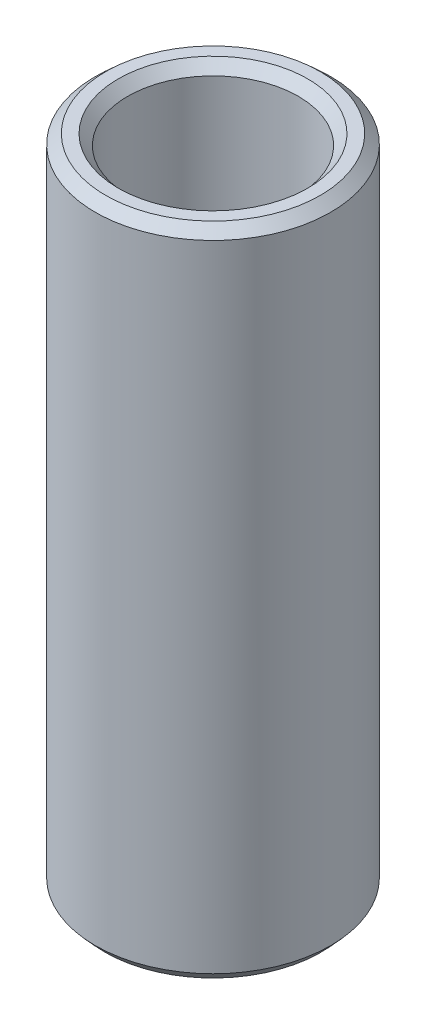
ISO-10303-21;
HEADER;
FILE_DESCRIPTION(('STEP AP214'),'2;1');
FILE_NAME('part.step','',(''),(''),'','','');
FILE_SCHEMA(('AUTOMOTIVE_DESIGN { 1 0 10303 214 1 1 1 1 }'));
ENDSEC;
DATA;
#1=APPLICATION_CONTEXT('core data for automotive mechanical design processes');
#2=APPLICATION_PROTOCOL_DEFINITION('international standard','automotive_design',2000,#1);
#3=PRODUCT_CONTEXT('',#1,'mechanical');
#4=PRODUCT('Part','Part','',(#3));
#5=PRODUCT_RELATED_PRODUCT_CATEGORY('part','',(#4));
#6=PRODUCT_DEFINITION_FORMATION('','',#4);
#7=PRODUCT_DEFINITION_CONTEXT('part definition',#1,'design');
#8=PRODUCT_DEFINITION('design','',#6,#7);
#9=PRODUCT_DEFINITION_SHAPE('','',#8);
#10=(LENGTH_UNIT() NAMED_UNIT(*) SI_UNIT(.MILLI.,.METRE.));
#11=(NAMED_UNIT(*) PLANE_ANGLE_UNIT() SI_UNIT($,.RADIAN.));
#12=(NAMED_UNIT(*) SI_UNIT($,.STERADIAN.) SOLID_ANGLE_UNIT());
#13=UNCERTAINTY_MEASURE_WITH_UNIT(LENGTH_MEASURE(1.E-05),#10,'distance_accuracy_value','');
#14=(GEOMETRIC_REPRESENTATION_CONTEXT(3) GLOBAL_UNCERTAINTY_ASSIGNED_CONTEXT((#13)) GLOBAL_UNIT_ASSIGNED_CONTEXT((#10,
#11,#12)) REPRESENTATION_CONTEXT('',''));
#15=CARTESIAN_POINT('',(0.,0.,0.));
#16=DIRECTION('',(0.,0.,1.));
#17=DIRECTION('',(1.,0.,0.));
#18=AXIS2_PLACEMENT_3D('',#15,#16,#17);
#19=CARTESIAN_POINT('',(0.,208.726118488771,0.));
#20=DIRECTION('',(0.,-1.,0.));
#21=DIRECTION('',(0.,0.,-1.));
#22=AXIS2_PLACEMENT_3D('',#19,#20,#21);
#23=CYLINDRICAL_SURFACE('',#22,37.5);
#24=CARTESIAN_POINT('',(0.,3.30998683425088,0.));
#25=DIRECTION('',(0.,1.,0.));
#26=DIRECTION('',(0.,0.,1.));
#27=AXIS2_PLACEMENT_3D('',#24,#25,#26);
#28=CIRCLE('',#27,37.5);
#29=CARTESIAN_POINT('',(0.,3.30998683425088,37.5));
#30=VERTEX_POINT('',#29);
#31=EDGE_CURVE('E10',#30,#30,#28,.T.);
#32=ORIENTED_EDGE('',*,*,#31,.T.);
#33=EDGE_LOOP('',(#32));
#34=FACE_BOUND('',#33,.T.);
#35=CARTESIAN_POINT('',(0.,205.71851136473,0.));
#36=DIRECTION('',(0.,1.,0.));
#37=DIRECTION('',(0.,0.,1.));
#38=AXIS2_PLACEMENT_3D('',#35,#36,#37);
#39=CIRCLE('',#38,37.5);
#40=CARTESIAN_POINT('',(0.,205.71851136473,-37.5));
#41=VERTEX_POINT('',#40);
#42=EDGE_CURVE('E50',#41,#41,#39,.F.);
#43=ORIENTED_EDGE('',*,*,#42,.T.);
#44=EDGE_LOOP('',(#43));
#45=FACE_BOUND('',#44,.T.);
#46=ADVANCED_FACE('F39',(#34,#45),#23,.T.);
#47=CARTESIAN_POINT('',(0.,208.726118488771,0.));
#48=DIRECTION('',(0.,1.,0.));
#49=DIRECTION('',(0.,0.,1.));
#50=AXIS2_PLACEMENT_3D('',#47,#48,#49);
#51=PLANE('',#50);
#52=CARTESIAN_POINT('',(0.,208.726118488771,0.));
#53=DIRECTION('',(0.,1.,0.));
#54=DIRECTION('',(0.,0.,1.));
#55=AXIS2_PLACEMENT_3D('',#52,#53,#54);
#56=CIRCLE('',#55,30.2008033606336);
#57=CARTESIAN_POINT('',(0.,208.726118488771,30.2008033606336));
#58=VERTEX_POINT('',#57);
#59=EDGE_CURVE('E58',#58,#58,#56,.F.);
#60=ORIENTED_EDGE('',*,*,#59,.T.);
#61=EDGE_LOOP('',(#60));
#62=FACE_BOUND('',#61,.T.);
#63=CARTESIAN_POINT('',(0.,208.726118488771,0.));
#64=DIRECTION('',(0.,1.,0.));
#65=DIRECTION('',(0.,0.,1.));
#66=AXIS2_PLACEMENT_3D('',#63,#64,#65);
#67=CIRCLE('',#66,34.190013165749);
#68=CARTESIAN_POINT('',(0.,208.726118488771,-34.1900131657491));
#69=VERTEX_POINT('',#68);
#70=EDGE_CURVE('E61',#69,#69,#67,.T.);
#71=ORIENTED_EDGE('',*,*,#70,.T.);
#72=EDGE_LOOP('',(#71));
#73=FACE_BOUND('',#72,.T.);
#74=ADVANCED_FACE('F88',(#62,#73),#51,.T.);
#75=CARTESIAN_POINT('',(0.,0.,0.));
#76=DIRECTION('',(0.,1.,0.));
#77=DIRECTION('',(0.,0.,1.));
#78=AXIS2_PLACEMENT_3D('',#75,#76,#77);
#79=PLANE('',#78);
#80=CARTESIAN_POINT('',(0.,0.,0.));
#81=DIRECTION('',(0.,1.,0.));
#82=DIRECTION('',(0.,0.,1.));
#83=AXIS2_PLACEMENT_3D('',#80,#81,#82);
#84=CIRCLE('',#83,30.5031830708436);
#85=CARTESIAN_POINT('',(0.,0.,-30.5031830708436));
#86=VERTEX_POINT('',#85);
#87=EDGE_CURVE('E51',#86,#86,#84,.T.);
#88=ORIENTED_EDGE('',*,*,#87,.T.);
#89=EDGE_LOOP('',(#88));
#90=FACE_BOUND('',#89,.T.);
#91=CARTESIAN_POINT('',(0.,0.,0.));
#92=DIRECTION('',(0.,1.,0.));
#93=DIRECTION('',(0.,0.,1.));
#94=AXIS2_PLACEMENT_3D('',#91,#92,#93);
#95=CIRCLE('',#94,34.4923928759591);
#96=CARTESIAN_POINT('',(0.,0.,34.4923928759591));
#97=VERTEX_POINT('',#96);
#98=EDGE_CURVE('E54',#97,#97,#95,.F.);
#99=ORIENTED_EDGE('',*,*,#98,.T.);
#100=EDGE_LOOP('',(#99));
#101=FACE_BOUND('',#100,.T.);
#102=ADVANCED_FACE('F83',(#90,#101),#79,.F.);
#103=CARTESIAN_POINT('',(0.,208.726118488771,0.));
#104=DIRECTION('',(0.,-1.,0.));
#105=DIRECTION('',(0.,0.,-1.));
#106=AXIS2_PLACEMENT_3D('',#103,#104,#105);
#107=CYLINDRICAL_SURFACE('',#106,27.1931962365927);
#108=CARTESIAN_POINT('',(0.,205.41613165452,0.));
#109=DIRECTION('',(0.,1.,0.));
#110=DIRECTION('',(0.,0.,1.));
#111=AXIS2_PLACEMENT_3D('',#108,#109,#110);
#112=CIRCLE('',#111,27.1931962365927);
#113=CARTESIAN_POINT('',(0.,205.41613165452,27.1931962365927));
#114=VERTEX_POINT('',#113);
#115=EDGE_CURVE('E67',#114,#114,#112,.T.);
#116=ORIENTED_EDGE('',*,*,#115,.T.);
#117=EDGE_LOOP('',(#116));
#118=FACE_BOUND('',#117,.T.);
#119=CARTESIAN_POINT('',(0.,3.00760712404091,0.));
#120=DIRECTION('',(0.,1.,0.));
#121=DIRECTION('',(0.,0.,1.));
#122=AXIS2_PLACEMENT_3D('',#119,#120,#121);
#123=CIRCLE('',#122,27.1931962365927);
#124=CARTESIAN_POINT('',(0.,3.00760712404091,-27.1931962365927));
#125=VERTEX_POINT('',#124);
#126=EDGE_CURVE('E69',#125,#125,#123,.F.);
#127=ORIENTED_EDGE('',*,*,#126,.T.);
#128=EDGE_LOOP('',(#127));
#129=FACE_BOUND('',#128,.T.);
#130=ADVANCED_FACE('F71',(#118,#129),#107,.F.);
#131=CARTESIAN_POINT('',(0.,205.41613165452,0.));
#132=DIRECTION('',(0.,1.,0.));
#133=DIRECTION('',(0.,0.,1.));
#134=AXIS2_PLACEMENT_3D('',#131,#132,#133);
#135=CONICAL_SURFACE('',#134,27.1931962365927,0.737571550273919);
#136=ORIENTED_EDGE('',*,*,#59,.F.);
#137=EDGE_LOOP('',(#136));
#138=FACE_BOUND('',#137,.T.);
#139=ORIENTED_EDGE('',*,*,#115,.F.);
#140=EDGE_LOOP('',(#139));
#141=FACE_BOUND('',#140,.T.);
#142=ADVANCED_FACE('F77',(#138,#141),#135,.F.);
#143=CARTESIAN_POINT('',(0.,0.,0.));
#144=DIRECTION('',(0.,-1.,0.));
#145=DIRECTION('',(0.,0.,-1.));
#146=AXIS2_PLACEMENT_3D('',#143,#144,#145);
#147=CONICAL_SURFACE('',#146,30.5031830708436,0.833224776520973);
#148=CARTESIAN_POINT('',(0.,3.00760712404091,-27.1931962365927));
#149=CARTESIAN_POINT('',(0.,2.97627788316549,-27.2276752661161));
#150=CARTESIAN_POINT('',(0.,2.94494864229006,-27.2621542956396));
#151=CARTESIAN_POINT('',(0.,2.88229016053921,-27.3311123546865));
#152=CARTESIAN_POINT('',(0.,2.85096091966378,-27.3655913842099));
#153=CARTESIAN_POINT('',(0.,2.78830243791293,-27.4345494432568));
#154=CARTESIAN_POINT('',(0.,2.7569731970375,-27.4690284727803));
#155=CARTESIAN_POINT('',(0.,2.69431471528665,-27.5379865318272));
#156=CARTESIAN_POINT('',(0.,2.66298547441122,-27.5724655613506));
#157=CARTESIAN_POINT('',(0.,2.60032699266037,-27.6414236203975));
#158=CARTESIAN_POINT('',(0.,2.56899775178494,-27.6759026499209));
#159=CARTESIAN_POINT('',(0.,2.50633927003409,-27.7448607089678));
#160=CARTESIAN_POINT('',(0.,2.47501002915867,-27.7793397384913));
#161=CARTESIAN_POINT('',(0.,2.41235154740781,-27.8482977975382));
#162=CARTESIAN_POINT('',(0.,2.38102230653239,-27.8827768270616));
#163=CARTESIAN_POINT('',(0.,2.31836382478154,-27.9517348861085));
#164=CARTESIAN_POINT('',(0.,2.28703458390611,-27.986213915632));
#165=CARTESIAN_POINT('',(0.,2.22437610215526,-28.0551719746789));
#166=CARTESIAN_POINT('',(0.,2.19304686127983,-28.0896510042023));
#167=CARTESIAN_POINT('',(0.,2.13038837952898,-28.1586090632492));
#168=CARTESIAN_POINT('',(0.,2.09905913865355,-28.1930880927727));
#169=CARTESIAN_POINT('',(0.,2.0364006569027,-28.2620461518195));
#170=CARTESIAN_POINT('',(0.,2.00507141602727,-28.296525181343));
#171=CARTESIAN_POINT('',(0.,1.94241293427642,-28.3654832403899));
#172=CARTESIAN_POINT('',(0.,1.911083693401,-28.3999622699133));
#173=CARTESIAN_POINT('',(0.,1.84842521165014,-28.4689203289602));
#174=CARTESIAN_POINT('',(0.,1.81709597077472,-28.5033993584837));
#175=CARTESIAN_POINT('',(0.,1.75443748902387,-28.5723574175306));
#176=CARTESIAN_POINT('',(0.,1.72310824814844,-28.606836447054));
#177=CARTESIAN_POINT('',(0.,1.66044976639759,-28.6757945061009));
#178=CARTESIAN_POINT('',(0.,1.62912052552216,-28.7102735356244));
#179=CARTESIAN_POINT('',(0.,1.56646204377131,-28.7792315946712));
#180=CARTESIAN_POINT('',(0.,1.53513280289588,-28.8137106241947));
#181=CARTESIAN_POINT('',(0.,1.47247432114503,-28.8826686832416));
#182=CARTESIAN_POINT('',(0.,1.4411450802696,-28.917147712765));
#183=CARTESIAN_POINT('',(0.,1.37848659851875,-28.9861057718119));
#184=CARTESIAN_POINT('',(0.,1.34715735764332,-29.0205848013354));
#185=CARTESIAN_POINT('',(0.,1.28449887589247,-29.0895428603823));
#186=CARTESIAN_POINT('',(0.,1.25316963501705,-29.1240218899057));
#187=CARTESIAN_POINT('',(0.,1.19051115326619,-29.1929799489526));
#188=CARTESIAN_POINT('',(0.,1.15918191239077,-29.2274589784761));
#189=CARTESIAN_POINT('',(0.,1.09652343063992,-29.296417037523));
#190=CARTESIAN_POINT('',(0.,1.06519418976449,-29.3308960670464));
#191=CARTESIAN_POINT('',(0.,1.00253570801364,-29.3998541260933));
#192=CARTESIAN_POINT('',(0.,0.971206467138211,-29.4343331556167));
#193=CARTESIAN_POINT('',(0.,0.908547985387359,-29.5032912146636));
#194=CARTESIAN_POINT('',(0.,0.877218744511932,-29.5377702441871));
#195=CARTESIAN_POINT('',(0.,0.81456026276108,-29.606728303234));
#196=CARTESIAN_POINT('',(0.,0.783231021885654,-29.6412073327574));
#197=CARTESIAN_POINT('',(0.,0.720572540134802,-29.7101653918043));
#198=CARTESIAN_POINT('',(0.,0.689243299259375,-29.7446444213278));
#199=CARTESIAN_POINT('',(0.,0.626584817508523,-29.8136024803747));
#200=CARTESIAN_POINT('',(0.,0.595255576633097,-29.8480815098981));
#201=CARTESIAN_POINT('',(0.,0.532597094882245,-29.917039568945));
#202=CARTESIAN_POINT('',(0.,0.501267854006819,-29.9515185984684));
#203=CARTESIAN_POINT('',(0.,0.438609372255966,-30.0204766575153));
#204=CARTESIAN_POINT('',(0.,0.40728013138054,-30.0549556870388));
#205=CARTESIAN_POINT('',(0.,0.344621649629688,-30.1239137460857));
#206=CARTESIAN_POINT('',(0.,0.313292408754261,-30.1583927756091));
#207=CARTESIAN_POINT('',(0.,0.250633927003409,-30.227350834656));
#208=CARTESIAN_POINT('',(0.,0.219304686127983,-30.2618298641795));
#209=CARTESIAN_POINT('',(0.,0.156646204377131,-30.3307879232264));
#210=CARTESIAN_POINT('',(0.,0.125316963501705,-30.3652669527498));
#211=CARTESIAN_POINT('',(0.,0.0626584817508521,-30.4342250117967));
#212=CARTESIAN_POINT('',(0.,0.0313292408754258,-30.4687040413201));
#213=CARTESIAN_POINT('',(0.,0.,-30.5031830708436));
#214=B_SPLINE_CURVE_WITH_KNOTS('',3,(#148,#149,#150,#151,#152,#153,#154,#155,#156,#157,#158,
#159,#160,#161,#162,#163,#164,#165,#166,#167,#168,#169,#170,#171,#172,#173,#174,#175,#176,#177,
#178,#179,#180,#181,#182,#183,#184,#185,#186,#187,#188,#189,#190,#191,#192,#193,#194,#195,#196,
#197,#198,#199,#200,#201,#202,#203,#204,#205,#206,#207,#208,#209,#210,#211,#212,#213),
.UNSPECIFIED.,.F.,.F.,(4,2,2,2,2,2,2,2,2,2,2,2,2,2,2,2,2,2,2,2,2,2,2,2,2,2,2,2,2,2,2,2,4),(0.,
0.139760235032654,0.279520470065307,0.419280705097964,0.559040940130617,0.698801175163271,
0.838561410195925,0.978321645228579,1.11808188026124,1.25784211529389,1.39760235032654,
1.5373625853592,1.67712282039185,1.81688305542451,1.95664329045716,2.09640352548981,
2.23616376052247,2.37592399555512,2.51568423058778,2.65544446562043,2.79520470065308,
2.93496493568574,3.07472517071839,3.21448540575105,3.3542456407837,3.49400587581635,
3.63376611084901,3.77352634588166,3.91328658091432,4.05304681594697,4.19280705097963,
4.33256728601228,4.47232752104494),.UNSPECIFIED.);
#215=EDGE_CURVE('BSEAM73',#125,#86,#214,.T.);
#216=ORIENTED_EDGE('',*,*,#126,.F.);
#217=ORIENTED_EDGE('',*,*,#87,.F.);
#218=ORIENTED_EDGE('',*,*,#215,.T.);
#219=ORIENTED_EDGE('',*,*,#215,.F.);
#220=EDGE_LOOP('',(#216,#218,#217,#219));
#221=FACE_BOUND('',#220,.T.);
#222=ADVANCED_FACE('F73',(#221),#147,.F.);
#223=CARTESIAN_POINT('',(0.,3.30998683425088,0.));
#224=DIRECTION('',(0.,1.,0.));
#225=DIRECTION('',(0.,0.,1.));
#226=AXIS2_PLACEMENT_3D('',#223,#224,#225);
#227=CONICAL_SURFACE('',#226,37.5,0.737571550273923);
#228=ORIENTED_EDGE('',*,*,#98,.F.);
#229=EDGE_LOOP('',(#228));
#230=FACE_BOUND('',#229,.T.);
#231=ORIENTED_EDGE('',*,*,#31,.F.);
#232=EDGE_LOOP('',(#231));
#233=FACE_BOUND('',#232,.T.);
#234=ADVANCED_FACE('F76',(#230,#233),#227,.T.);
#235=CARTESIAN_POINT('',(0.,208.726118488771,0.));
#236=DIRECTION('',(0.,-1.,0.));
#237=DIRECTION('',(0.,0.,-1.));
#238=AXIS2_PLACEMENT_3D('',#235,#236,#237);
#239=CONICAL_SURFACE('',#238,34.190013165749,0.833224776520977);
#240=CARTESIAN_POINT('',(0.,205.71851136473,-37.5));
#241=CARTESIAN_POINT('',(0.,205.749840605605,-37.4655209704766));
#242=CARTESIAN_POINT('',(0.,205.781169846481,-37.4310419409531));
#243=CARTESIAN_POINT('',(0.,205.843828328231,-37.3620838819062));
#244=CARTESIAN_POINT('',(0.,205.875157569107,-37.3276048523828));
#245=CARTESIAN_POINT('',(0.,205.937816050858,-37.2586467933359));
#246=CARTESIAN_POINT('',(0.,205.969145291733,-37.2241677638124));
#247=CARTESIAN_POINT('',(0.,206.031803773484,-37.1552097047655));
#248=CARTESIAN_POINT('',(0.,206.063133014359,-37.1207306752421));
#249=CARTESIAN_POINT('',(0.,206.12579149611,-37.0517726161952));
#250=CARTESIAN_POINT('',(0.,206.157120736986,-37.0172935866718));
#251=CARTESIAN_POINT('',(0.,206.219779218737,-36.9483355276249));
#252=CARTESIAN_POINT('',(0.,206.251108459612,-36.9138564981014));
#253=CARTESIAN_POINT('',(0.,206.313766941363,-36.8448984390545));
#254=CARTESIAN_POINT('',(0.,206.345096182238,-36.8104194095311));
#255=CARTESIAN_POINT('',(0.,206.407754663989,-36.7414613504842));
#256=CARTESIAN_POINT('',(0.,206.439083904865,-36.7069823209607));
#257=CARTESIAN_POINT('',(0.,206.501742386615,-36.6380242619138));
#258=CARTESIAN_POINT('',(0.,206.533071627491,-36.6035452323904));
#259=CARTESIAN_POINT('',(0.,206.595730109242,-36.5345871733435));
#260=CARTESIAN_POINT('',(0.,206.627059350117,-36.5001081438201));
#261=CARTESIAN_POINT('',(0.,206.689717831868,-36.4311500847732));
#262=CARTESIAN_POINT('',(0.,206.721047072743,-36.3966710552497));
#263=CARTESIAN_POINT('',(0.,206.783705554494,-36.3277129962028));
#264=CARTESIAN_POINT('',(0.,206.81503479537,-36.2932339666794));
#265=CARTESIAN_POINT('',(0.,206.877693277121,-36.2242759076325));
#266=CARTESIAN_POINT('',(0.,206.909022517996,-36.189796878109));
#267=CARTESIAN_POINT('',(0.,206.971680999747,-36.1208388190621));
#268=CARTESIAN_POINT('',(0.,207.003010240622,-36.0863597895387));
#269=CARTESIAN_POINT('',(0.,207.065668722373,-36.0174017304918));
#270=CARTESIAN_POINT('',(0.,207.096997963249,-35.9829227009683));
#271=CARTESIAN_POINT('',(0.,207.159656444999,-35.9139646419214));
#272=CARTESIAN_POINT('',(0.,207.190985685875,-35.879485612398));
#273=CARTESIAN_POINT('',(0.,207.253644167626,-35.8105275533511));
#274=CARTESIAN_POINT('',(0.,207.284973408501,-35.7760485238276));
#275=CARTESIAN_POINT('',(0.,207.347631890252,-35.7070904647808));
#276=CARTESIAN_POINT('',(0.,207.378961131127,-35.6726114352573));
#277=CARTESIAN_POINT('',(0.,207.441619612878,-35.6036533762104));
#278=CARTESIAN_POINT('',(0.,207.472948853754,-35.569174346687));
#279=CARTESIAN_POINT('',(0.,207.535607335505,-35.5002162876401));
#280=CARTESIAN_POINT('',(0.,207.56693657638,-35.4657372581166));
#281=CARTESIAN_POINT('',(0.,207.629595058131,-35.3967791990697));
#282=CARTESIAN_POINT('',(0.,207.660924299006,-35.3623001695463));
#283=CARTESIAN_POINT('',(0.,207.723582780757,-35.2933421104994));
#284=CARTESIAN_POINT('',(0.,207.754912021632,-35.2588630809759));
#285=CARTESIAN_POINT('',(0.,207.817570503383,-35.189905021929));
#286=CARTESIAN_POINT('',(0.,207.848899744259,-35.1554259924056));
#287=CARTESIAN_POINT('',(0.,207.91155822601,-35.0864679333587));
#288=CARTESIAN_POINT('',(0.,207.942887466885,-35.0519889038353));
#289=CARTESIAN_POINT('',(0.,208.005545948636,-34.9830308447883));
#290=CARTESIAN_POINT('',(0.,208.036875189511,-34.9485518152649));
#291=CARTESIAN_POINT('',(0.,208.099533671262,-34.879593756218));
#292=CARTESIAN_POINT('',(0.,208.130862912138,-34.8451147266946));
#293=CARTESIAN_POINT('',(0.,208.193521393888,-34.7761566676477));
#294=CARTESIAN_POINT('',(0.,208.224850634764,-34.7416776381242));
#295=CARTESIAN_POINT('',(0.,208.287509116515,-34.6727195790773));
#296=CARTESIAN_POINT('',(0.,208.31883835739,-34.6382405495539));
#297=CARTESIAN_POINT('',(0.,208.381496839141,-34.569282490507));
#298=CARTESIAN_POINT('',(0.,208.412826080016,-34.5348034609835));
#299=CARTESIAN_POINT('',(0.,208.475484561767,-34.4658454019366));
#300=CARTESIAN_POINT('',(0.,208.506813802643,-34.4313663724132));
#301=CARTESIAN_POINT('',(0.,208.569472284394,-34.3624083133663));
#302=CARTESIAN_POINT('',(0.,208.600801525269,-34.3279292838428));
#303=CARTESIAN_POINT('',(0.,208.66346000702,-34.2589712247959));
#304=CARTESIAN_POINT('',(0.,208.694789247895,-34.2244921952725));
#305=CARTESIAN_POINT('',(0.,208.726118488771,-34.1900131657491));
#306=B_SPLINE_CURVE_WITH_KNOTS('',3,(#240,#241,#242,#243,#244,#245,#246,#247,#248,#249,#250,
#251,#252,#253,#254,#255,#256,#257,#258,#259,#260,#261,#262,#263,#264,#265,#266,#267,#268,#269,
#270,#271,#272,#273,#274,#275,#276,#277,#278,#279,#280,#281,#282,#283,#284,#285,#286,#287,#288,
#289,#290,#291,#292,#293,#294,#295,#296,#297,#298,#299,#300,#301,#302,#303,#304,#305),
.UNSPECIFIED.,.F.,.F.,(4,2,2,2,2,2,2,2,2,2,2,2,2,2,2,2,2,2,2,2,2,2,2,2,2,2,2,2,2,2,2,2,4),(0.,
0.139760235032659,0.279520470065312,0.419280705097971,0.559040940130629,0.698801175163288,
0.838561410195947,0.978321645228605,1.11808188026126,1.25784211529392,1.39760235032658,
1.53736258535922,1.67712282039187,1.81688305542453,1.95664329045719,2.09640352548985,
2.23616376052251,2.37592399555517,2.51568423058782,2.65544446562048,2.79520470065314,
2.9349649356858,3.07472517071844,3.2144854057511,3.35424564078376,3.49400587581641,
3.63376611084907,3.77352634588173,3.91328658091438,4.05304681594704,4.1928070509797,
4.33256728601236,4.47232752104502),.UNSPECIFIED.);
#307=EDGE_CURVE('BSEAM45',#41,#69,#306,.T.);
#308=ORIENTED_EDGE('',*,*,#42,.F.);
#309=ORIENTED_EDGE('',*,*,#70,.F.);
#310=ORIENTED_EDGE('',*,*,#307,.T.);
#311=ORIENTED_EDGE('',*,*,#307,.F.);
#312=EDGE_LOOP('',(#308,#310,#309,#311));
#313=FACE_BOUND('',#312,.T.);
#314=ADVANCED_FACE('F45',(#313),#239,.T.);
#315=CLOSED_SHELL('',(#46,#74,#102,#130,#142,#222,#234,#314));
#316=MANIFOLD_SOLID_BREP('B2',#315);
#317=ADVANCED_BREP_SHAPE_REPRESENTATION('',(#18,#316),#14);
#318=SHAPE_DEFINITION_REPRESENTATION(#9,#317);
ENDSEC;
END-ISO-10303-21;
